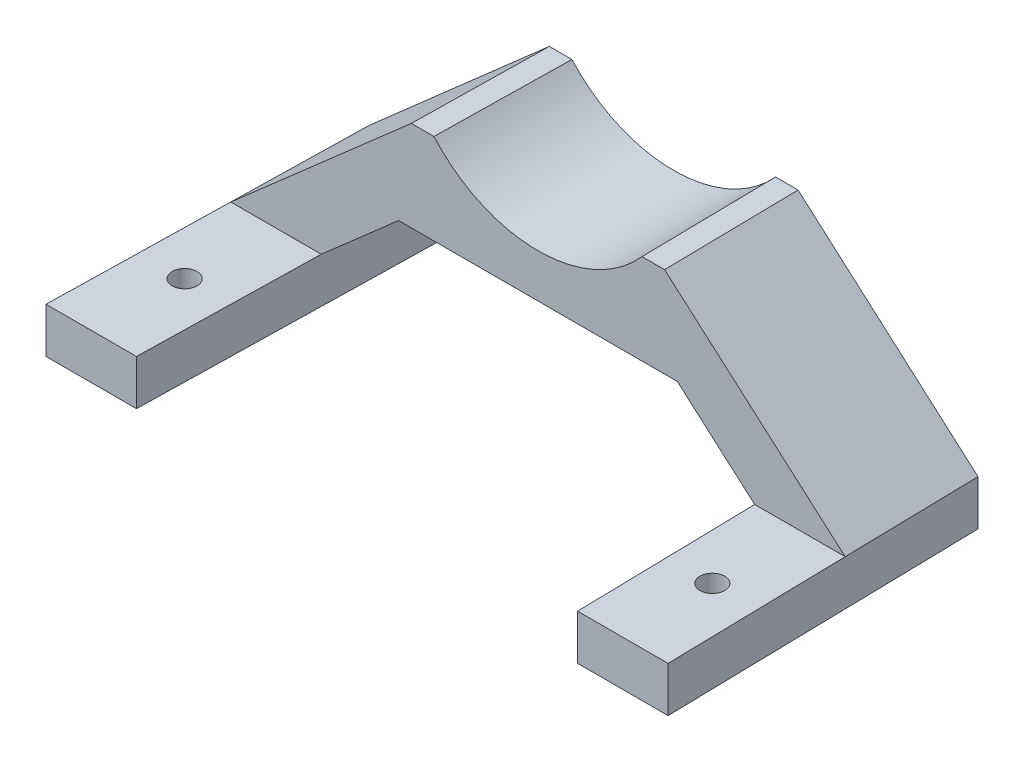
ISO-10303-21;
HEADER;
FILE_DESCRIPTION(('STEP AP214'),'2;1');
FILE_NAME('part.step','',(''),(''),'','','');
FILE_SCHEMA(('AUTOMOTIVE_DESIGN { 1 0 10303 214 1 1 1 1 }'));
ENDSEC;
DATA;
#1=APPLICATION_CONTEXT('core data for automotive mechanical design processes');
#2=APPLICATION_PROTOCOL_DEFINITION('international standard','automotive_design',2000,#1);
#3=PRODUCT_CONTEXT('',#1,'mechanical');
#4=PRODUCT('Part','Part','',(#3));
#5=PRODUCT_RELATED_PRODUCT_CATEGORY('part','',(#4));
#6=PRODUCT_DEFINITION_FORMATION('','',#4);
#7=PRODUCT_DEFINITION_CONTEXT('part definition',#1,'design');
#8=PRODUCT_DEFINITION('design','',#6,#7);
#9=PRODUCT_DEFINITION_SHAPE('','',#8);
#10=(LENGTH_UNIT() NAMED_UNIT(*) SI_UNIT(.MILLI.,.METRE.));
#11=(NAMED_UNIT(*) PLANE_ANGLE_UNIT() SI_UNIT($,.RADIAN.));
#12=(NAMED_UNIT(*) SI_UNIT($,.STERADIAN.) SOLID_ANGLE_UNIT());
#13=UNCERTAINTY_MEASURE_WITH_UNIT(LENGTH_MEASURE(1.E-05),#10,'distance_accuracy_value','');
#14=(GEOMETRIC_REPRESENTATION_CONTEXT(3) GLOBAL_UNCERTAINTY_ASSIGNED_CONTEXT((#13)) GLOBAL_UNIT_ASSIGNED_CONTEXT((#10,
#11,#12)) REPRESENTATION_CONTEXT('',''));
#15=CARTESIAN_POINT('',(0.,0.,0.));
#16=DIRECTION('',(0.,0.,1.));
#17=DIRECTION('',(1.,0.,0.));
#18=AXIS2_PLACEMENT_3D('',#15,#16,#17);
#19=CARTESIAN_POINT('',(0.,10.,0.));
#20=DIRECTION('',(0.,1.,0.));
#21=DIRECTION('',(0.,0.,1.));
#22=AXIS2_PLACEMENT_3D('',#19,#20,#21);
#23=PLANE('',#22);
#24=CARTESIAN_POINT('',(10.43092460845,10.,-20.2120416113355));
#25=DIRECTION('',(0.,1.,0.));
#26=DIRECTION('',(0.,0.,1.));
#27=AXIS2_PLACEMENT_3D('',#24,#25,#26);
#28=CIRCLE('',#27,2.75);
#29=CARTESIAN_POINT('',(10.43092460845,10.,-17.4620416113355));
#30=VERTEX_POINT('',#29);
#31=EDGE_CURVE('E724',#30,#30,#28,.T.);
#32=ORIENTED_EDGE('',*,*,#31,.F.);
#33=EDGE_LOOP('',(#32));
#34=FACE_BOUND('',#33,.T.);
#35=DIRECTION('',(0.0212041611335489,0.,-0.99977516650026));
#36=VECTOR('',#35,1.);
#37=CARTESIAN_POINT('',(20.0044976812242,10.,0.));
#38=LINE('',#37,#36);
#39=CARTESIAN_POINT('',(20.0044976812242,10.,0.));
#40=VERTEX_POINT('',#39);
#41=CARTESIAN_POINT('',(20.852854865681,10.,-40.0000000000001));
#42=VERTEX_POINT('',#41);
#43=EDGE_CURVE('E752',#40,#42,#38,.T.);
#44=ORIENTED_EDGE('',*,*,#43,.T.);
#45=DIRECTION('',(-1.,0.,0.));
#46=VECTOR('',#45,1.);
#47=CARTESIAN_POINT('',(0.848357184456768,10.,-40.));
#48=LINE('',#47,#46);
#49=CARTESIAN_POINT('',(0.848357184456767,10.,-40.));
#50=VERTEX_POINT('',#49);
#51=EDGE_CURVE('E96',#42,#50,#48,.T.);
#52=ORIENTED_EDGE('',*,*,#51,.T.);
#53=DIRECTION('',(-0.0212041611335489,0.,0.99977516650026));
#54=VECTOR('',#53,1.);
#55=CARTESIAN_POINT('',(1.48462507279934,10.,-70.));
#56=LINE('',#55,#54);
#57=CARTESIAN_POINT('',(0.,10.,0.));
#58=VERTEX_POINT('',#57);
#59=EDGE_CURVE('E743',#50,#58,#56,.T.);
#60=ORIENTED_EDGE('',*,*,#59,.T.);
#61=DIRECTION('',(1.,0.,0.));
#62=VECTOR('',#61,1.);
#63=CARTESIAN_POINT('',(0.,10.,0.));
#64=LINE('',#63,#62);
#65=EDGE_CURVE('E739',#58,#40,#64,.T.);
#66=ORIENTED_EDGE('',*,*,#65,.T.);
#67=EDGE_LOOP('',(#44,#52,#60,#66));
#68=FACE_BOUND('',#67,.T.);
#69=ADVANCED_FACE('F78',(#34,#68),#23,.T.);
#70=CARTESIAN_POINT('',(0.,0.,0.));
#71=DIRECTION('',(0.,1.,0.));
#72=DIRECTION('',(0.,0.,1.));
#73=AXIS2_PLACEMENT_3D('',#70,#71,#72);
#74=PLANE('',#73);
#75=DIRECTION('',(-0.0212041611335489,0.,0.99977516650026));
#76=VECTOR('',#75,1.);
#77=CARTESIAN_POINT('',(1.48462507279934,0.,-70.));
#78=LINE('',#77,#76);
#79=CARTESIAN_POINT('',(1.48462507279934,0.,-70.));
#80=VERTEX_POINT('',#79);
#81=CARTESIAN_POINT('',(0.,0.,0.));
#82=VERTEX_POINT('',#81);
#83=EDGE_CURVE('E733',#80,#82,#78,.T.);
#84=ORIENTED_EDGE('',*,*,#83,.F.);
#85=DIRECTION('',(-1.,0.,0.));
#86=VECTOR('',#85,1.);
#87=CARTESIAN_POINT('',(21.4891227540235,0.,-70.));
#88=LINE('',#87,#86);
#89=CARTESIAN_POINT('',(21.4891227540235,0.,-70.));
#90=VERTEX_POINT('',#89);
#91=EDGE_CURVE('E1061',#90,#80,#88,.T.);
#92=ORIENTED_EDGE('',*,*,#91,.F.);
#93=DIRECTION('',(0.0212041611335489,0.,-0.99977516650026));
#94=VECTOR('',#93,1.);
#95=CARTESIAN_POINT('',(20.0044976812242,0.,0.));
#96=LINE('',#95,#94);
#97=CARTESIAN_POINT('',(20.0044976812242,0.,0.));
#98=VERTEX_POINT('',#97);
#99=EDGE_CURVE('E1055',#98,#90,#96,.T.);
#100=ORIENTED_EDGE('',*,*,#99,.F.);
#101=DIRECTION('',(1.,0.,0.));
#102=VECTOR('',#101,1.);
#103=CARTESIAN_POINT('',(0.,0.,0.));
#104=LINE('',#103,#102);
#105=EDGE_CURVE('E1047',#82,#98,#104,.T.);
#106=ORIENTED_EDGE('',*,*,#105,.F.);
#107=EDGE_LOOP('',(#84,#92,#100,#106));
#108=FACE_BOUND('',#107,.T.);
#109=CARTESIAN_POINT('',(10.43092460845,0.,-20.2120416113355));
#110=DIRECTION('',(0.,1.,0.));
#111=DIRECTION('',(0.,0.,1.));
#112=AXIS2_PLACEMENT_3D('',#109,#110,#111);
#113=CIRCLE('',#112,2.75);
#114=CARTESIAN_POINT('',(10.43092460845,0.,-17.4620416113355));
#115=VERTEX_POINT('',#114);
#116=EDGE_CURVE('E346',#115,#115,#113,.T.);
#117=ORIENTED_EDGE('',*,*,#116,.T.);
#118=EDGE_LOOP('',(#117));
#119=FACE_BOUND('',#118,.T.);
#120=ADVANCED_FACE('F376',(#108,#119),#74,.F.);
#121=CARTESIAN_POINT('',(1.48462507279934,10.,-70.));
#122=DIRECTION('',(0.99977516650026,0.,0.0212041611335489));
#123=DIRECTION('',(0.0212041611335489,0.,-0.99977516650026));
#124=AXIS2_PLACEMENT_3D('',#121,#122,#123);
#125=PLANE('',#124);
#126=ORIENTED_EDGE('',*,*,#83,.T.);
#127=DIRECTION('',(0.,-1.,0.));
#128=VECTOR('',#127,1.);
#129=CARTESIAN_POINT('',(0.,10.,0.));
#130=LINE('',#129,#128);
#131=EDGE_CURVE('E14',#58,#82,#130,.T.);
#132=ORIENTED_EDGE('',*,*,#131,.F.);
#133=ORIENTED_EDGE('',*,*,#59,.F.);
#134=CARTESIAN_POINT('',(1.48462507279934,10.,-70.));
#135=VERTEX_POINT('',#134);
#136=EDGE_CURVE('E746',#135,#50,#56,.T.);
#137=ORIENTED_EDGE('',*,*,#136,.F.);
#138=DIRECTION('',(0.,-1.,0.));
#139=VECTOR('',#138,1.);
#140=CARTESIAN_POINT('',(1.48462507279934,10.,-70.));
#141=LINE('',#140,#139);
#142=EDGE_CURVE('E425',#135,#80,#141,.T.);
#143=ORIENTED_EDGE('',*,*,#142,.T.);
#144=EDGE_LOOP('',(#126,#132,#133,#137,#143));
#145=FACE_BOUND('',#144,.T.);
#146=ADVANCED_FACE('F80',(#145),#125,.F.);
#147=CARTESIAN_POINT('',(0.,10.,0.));
#148=DIRECTION('',(0.,0.,-1.));
#149=DIRECTION('',(-1.,0.,0.));
#150=AXIS2_PLACEMENT_3D('',#147,#148,#149);
#151=PLANE('',#150);
#152=ORIENTED_EDGE('',*,*,#105,.T.);
#153=DIRECTION('',(0.,-1.,0.));
#154=VECTOR('',#153,1.);
#155=CARTESIAN_POINT('',(20.0044976812242,10.,0.));
#156=LINE('',#155,#154);
#157=EDGE_CURVE('E88',#40,#98,#156,.T.);
#158=ORIENTED_EDGE('',*,*,#157,.F.);
#159=ORIENTED_EDGE('',*,*,#65,.F.);
#160=ORIENTED_EDGE('',*,*,#131,.T.);
#161=EDGE_LOOP('',(#152,#158,#159,#160));
#162=FACE_BOUND('',#161,.T.);
#163=ADVANCED_FACE('F994',(#162),#151,.F.);
#164=CARTESIAN_POINT('',(20.0044976812242,10.,0.));
#165=DIRECTION('',(-0.99977516650026,0.,-0.0212041611335489));
#166=DIRECTION('',(-0.0212041611335489,0.,0.99977516650026));
#167=AXIS2_PLACEMENT_3D('',#164,#165,#166);
#168=PLANE('',#167);
#169=ORIENTED_EDGE('',*,*,#99,.T.);
#170=DIRECTION('',(0.,-1.,0.));
#171=VECTOR('',#170,1.);
#172=CARTESIAN_POINT('',(21.4891227540235,10.,-70.));
#173=LINE('',#172,#171);
#174=CARTESIAN_POINT('',(21.4891227540235,10.,-70.));
#175=VERTEX_POINT('',#174);
#176=EDGE_CURVE('E751',#175,#90,#173,.T.);
#177=ORIENTED_EDGE('',*,*,#176,.F.);
#178=DIRECTION('',(-0.0212041611335488,0.,0.99977516650026));
#179=VECTOR('',#178,1.);
#180=CARTESIAN_POINT('',(21.4891227540235,10.,-70.));
#181=LINE('',#180,#179);
#182=EDGE_CURVE('E104',#175,#42,#181,.T.);
#183=ORIENTED_EDGE('',*,*,#182,.T.);
#184=ORIENTED_EDGE('',*,*,#43,.F.);
#185=ORIENTED_EDGE('',*,*,#157,.T.);
#186=EDGE_LOOP('',(#169,#177,#183,#184,#185));
#187=FACE_BOUND('',#186,.T.);
#188=ADVANCED_FACE('F375',(#187),#168,.F.);
#189=CARTESIAN_POINT('',(21.4891227540235,10.,-70.));
#190=DIRECTION('',(0.,0.,1.));
#191=DIRECTION('',(1.,0.,0.));
#192=AXIS2_PLACEMENT_3D('',#189,#190,#191);
#193=PLANE('',#192);
#194=ORIENTED_EDGE('',*,*,#91,.T.);
#195=ORIENTED_EDGE('',*,*,#142,.F.);
#196=DIRECTION('',(0.750766193418776,0.660568030424938,0.));
#197=VECTOR('',#196,1.);
#198=CARTESIAN_POINT('',(41.2637478268229,45.,-70.));
#199=LINE('',#198,#197);
#200=CARTESIAN_POINT('',(41.2637478268229,45.,-70.));
#201=VERTEX_POINT('',#200);
#202=EDGE_CURVE('E266',#135,#201,#199,.T.);
#203=ORIENTED_EDGE('',*,*,#202,.T.);
#204=DIRECTION('',(1.,0.,0.));
#205=VECTOR('',#204,1.);
#206=CARTESIAN_POINT('',(46.2637478268229,45.,-70.));
#207=LINE('',#206,#205);
#208=CARTESIAN_POINT('',(46.2637478268229,45.,-70.));
#209=VERTEX_POINT('',#208);
#210=EDGE_CURVE('E260',#201,#209,#207,.T.);
#211=ORIENTED_EDGE('',*,*,#210,.T.);
#212=CARTESIAN_POINT('',(68.7637478268229,65.3125,-70.));
#213=DIRECTION('',(0.,0.,1.));
#214=DIRECTION('',(-1.,0.,0.));
#215=AXIS2_PLACEMENT_3D('',#212,#213,#214);
#216=CIRCLE('',#215,30.3125);
#217=CARTESIAN_POINT('',(91.2637478268229,45.,-70.));
#218=VERTEX_POINT('',#217);
#219=EDGE_CURVE('E254',#209,#218,#216,.T.);
#220=ORIENTED_EDGE('',*,*,#219,.T.);
#221=DIRECTION('',(1.,0.,0.));
#222=VECTOR('',#221,1.);
#223=CARTESIAN_POINT('',(91.2637478268229,45.,-70.));
#224=LINE('',#223,#222);
#225=CARTESIAN_POINT('',(96.2637478268229,45.,-70.));
#226=VERTEX_POINT('',#225);
#227=EDGE_CURVE('E296',#218,#226,#224,.T.);
#228=ORIENTED_EDGE('',*,*,#227,.T.);
#229=DIRECTION('',(0.750766193418776,-0.660568030424938,0.));
#230=VECTOR('',#229,1.);
#231=CARTESIAN_POINT('',(136.042870580846,10.,-70.));
#232=LINE('',#231,#230);
#233=CARTESIAN_POINT('',(136.042870580846,10.,-70.));
#234=VERTEX_POINT('',#233);
#235=EDGE_CURVE('E291',#226,#234,#232,.T.);
#236=ORIENTED_EDGE('',*,*,#235,.T.);
#237=DIRECTION('',(0.,-1.,0.));
#238=VECTOR('',#237,1.);
#239=CARTESIAN_POINT('',(136.042870580846,10.,-70.));
#240=LINE('',#239,#238);
#241=CARTESIAN_POINT('',(136.042870580846,0.,-70.));
#242=VERTEX_POINT('',#241);
#243=EDGE_CURVE('E202',#234,#242,#240,.T.);
#244=ORIENTED_EDGE('',*,*,#243,.T.);
#245=DIRECTION('',(-1.,0.,0.));
#246=VECTOR('',#245,1.);
#247=CARTESIAN_POINT('',(116.038372899622,0.,-70.));
#248=LINE('',#247,#246);
#249=CARTESIAN_POINT('',(116.038372899622,0.,-70.));
#250=VERTEX_POINT('',#249);
#251=EDGE_CURVE('E196',#242,#250,#248,.T.);
#252=ORIENTED_EDGE('',*,*,#251,.T.);
#253=DIRECTION('',(0.,-1.,0.));
#254=VECTOR('',#253,1.);
#255=CARTESIAN_POINT('',(116.038372899622,10.,-70.));
#256=LINE('',#255,#254);
#257=CARTESIAN_POINT('',(116.038372899622,10.,-70.));
#258=VERTEX_POINT('',#257);
#259=EDGE_CURVE('E199',#258,#250,#256,.T.);
#260=ORIENTED_EDGE('',*,*,#259,.F.);
#261=DIRECTION('',(-0.750766193418776,0.660568030424938,0.));
#262=VECTOR('',#261,1.);
#263=CARTESIAN_POINT('',(98.9901774336121,25.,-70.));
#264=LINE('',#263,#262);
#265=CARTESIAN_POINT('',(98.9901774336121,25.,-70.));
#266=VERTEX_POINT('',#265);
#267=EDGE_CURVE('E286',#258,#266,#264,.T.);
#268=ORIENTED_EDGE('',*,*,#267,.T.);
#269=DIRECTION('',(-1.,0.,0.));
#270=VECTOR('',#269,1.);
#271=CARTESIAN_POINT('',(98.9901774336121,25.,-70.));
#272=LINE('',#271,#270);
#273=CARTESIAN_POINT('',(38.5373182200336,25.,-70.));
#274=VERTEX_POINT('',#273);
#275=EDGE_CURVE('E281',#266,#274,#272,.T.);
#276=ORIENTED_EDGE('',*,*,#275,.T.);
#277=DIRECTION('',(-0.750766193418776,-0.660568030424938,0.));
#278=VECTOR('',#277,1.);
#279=CARTESIAN_POINT('',(38.5373182200336,25.,-70.));
#280=LINE('',#279,#278);
#281=EDGE_CURVE('E275',#274,#175,#280,.T.);
#282=ORIENTED_EDGE('',*,*,#281,.T.);
#283=ORIENTED_EDGE('',*,*,#176,.T.);
#284=EDGE_LOOP('',(#194,#195,#203,#211,#220,#228,#236,#244,#252,#260,#268,#276,#282,#283));
#285=FACE_BOUND('',#284,.T.);
#286=ADVANCED_FACE('F198',(#285),#193,.F.);
#287=CARTESIAN_POINT('',(10.43092460845,10.,-20.2120416113355));
#288=DIRECTION('',(0.,-1.,0.));
#289=DIRECTION('',(0.,0.,-1.));
#290=AXIS2_PLACEMENT_3D('',#287,#288,#289);
#291=CYLINDRICAL_SURFACE('',#290,2.75);
#292=ORIENTED_EDGE('',*,*,#31,.T.);
#293=EDGE_LOOP('',(#292));
#294=FACE_BOUND('',#293,.T.);
#295=ORIENTED_EDGE('',*,*,#116,.F.);
#296=EDGE_LOOP('',(#295));
#297=FACE_BOUND('',#296,.T.);
#298=ADVANCED_FACE('F374',(#294,#297),#291,.F.);
#299=CARTESIAN_POINT('',(68.7637478268229,65.3125,-40.));
#300=DIRECTION('',(0.,0.,-1.));
#301=DIRECTION('',(-1.,0.,0.));
#302=AXIS2_PLACEMENT_3D('',#299,#300,#301);
#303=PLANE('',#302);
#304=DIRECTION('',(-1.,0.,0.));
#305=VECTOR('',#304,1.);
#306=CARTESIAN_POINT('',(116.674640787965,10.,-40.));
#307=LINE('',#306,#305);
#308=CARTESIAN_POINT('',(136.679138469189,10.,-40.));
#309=VERTEX_POINT('',#308);
#310=CARTESIAN_POINT('',(116.674640787965,10.,-40.));
#311=VERTEX_POINT('',#310);
#312=EDGE_CURVE('E309',#309,#311,#307,.T.);
#313=ORIENTED_EDGE('',*,*,#312,.F.);
#314=DIRECTION('',(0.751885170244489,-0.659294085189922,0.));
#315=VECTOR('',#314,1.);
#316=CARTESIAN_POINT('',(136.679138469189,10.,-40.));
#317=LINE('',#316,#315);
#318=CARTESIAN_POINT('',(96.7637478268229,45.,-40.));
#319=VERTEX_POINT('',#318);
#320=EDGE_CURVE('E304',#319,#309,#317,.T.);
#321=ORIENTED_EDGE('',*,*,#320,.F.);
#322=DIRECTION('',(1.,0.,0.));
#323=VECTOR('',#322,1.);
#324=CARTESIAN_POINT('',(96.7637478268229,45.,-40.));
#325=LINE('',#324,#323);
#326=CARTESIAN_POINT('',(91.7637478268229,45.,-40.));
#327=VERTEX_POINT('',#326);
#328=EDGE_CURVE('E308',#327,#319,#325,.T.);
#329=ORIENTED_EDGE('',*,*,#328,.F.);
#330=CARTESIAN_POINT('',(68.7637478268229,65.3125,-40.));
#331=DIRECTION('',(0.,0.,1.));
#332=DIRECTION('',(-1.,0.,0.));
#333=AXIS2_PLACEMENT_3D('',#330,#331,#332);
#334=CIRCLE('',#333,30.6854632725334);
#335=CARTESIAN_POINT('',(45.7637478268229,45.,-40.));
#336=VERTEX_POINT('',#335);
#337=EDGE_CURVE('E314',#336,#327,#334,.T.);
#338=ORIENTED_EDGE('',*,*,#337,.F.);
#339=DIRECTION('',(1.,0.,0.));
#340=VECTOR('',#339,1.);
#341=CARTESIAN_POINT('',(45.7637478268229,45.,-40.));
#342=LINE('',#341,#340);
#343=CARTESIAN_POINT('',(40.7637478268229,45.,-40.));
#344=VERTEX_POINT('',#343);
#345=EDGE_CURVE('E319',#344,#336,#342,.T.);
#346=ORIENTED_EDGE('',*,*,#345,.F.);
#347=DIRECTION('',(0.751885170244489,0.659294085189922,0.));
#348=VECTOR('',#347,1.);
#349=CARTESIAN_POINT('',(40.7637478268229,45.,-40.));
#350=LINE('',#349,#348);
#351=EDGE_CURVE('E324',#50,#344,#350,.T.);
#352=ORIENTED_EDGE('',*,*,#351,.F.);
#353=ORIENTED_EDGE('',*,*,#51,.F.);
#354=DIRECTION('',(-0.751885170244489,-0.659294085189921,0.));
#355=VECTOR('',#354,1.);
#356=CARTESIAN_POINT('',(20.852854865681,10.,-40.));
#357=LINE('',#356,#355);
#358=CARTESIAN_POINT('',(37.9594508552665,25.,-40.));
#359=VERTEX_POINT('',#358);
#360=EDGE_CURVE('E331',#359,#42,#357,.T.);
#361=ORIENTED_EDGE('',*,*,#360,.F.);
#362=DIRECTION('',(-1.,0.,0.));
#363=VECTOR('',#362,1.);
#364=CARTESIAN_POINT('',(99.5680447983793,25.,-40.));
#365=LINE('',#364,#363);
#366=CARTESIAN_POINT('',(99.5680447983793,25.,-40.));
#367=VERTEX_POINT('',#366);
#368=EDGE_CURVE('E335',#367,#359,#365,.T.);
#369=ORIENTED_EDGE('',*,*,#368,.F.);
#370=DIRECTION('',(-0.751885170244489,0.659294085189922,0.));
#371=VECTOR('',#370,1.);
#372=CARTESIAN_POINT('',(99.5680447983793,25.,-40.));
#373=LINE('',#372,#371);
#374=EDGE_CURVE('E340',#311,#367,#373,.T.);
#375=ORIENTED_EDGE('',*,*,#374,.F.);
#376=EDGE_LOOP('',(#313,#321,#329,#338,#346,#352,#353,#361,#369,#375));
#377=FACE_BOUND('',#376,.T.);
#378=ADVANCED_FACE('F644',(#377),#303,.F.);
#379=CARTESIAN_POINT('',(0.,45.,0.));
#380=DIRECTION('',(0.,1.,0.));
#381=DIRECTION('',(0.,0.,1.));
#382=AXIS2_PLACEMENT_3D('',#379,#380,#381);
#383=PLANE('',#382);
#384=DIRECTION('',(-0.0166643523339933,0.,0.9998611400396));
#385=VECTOR('',#384,1.);
#386=CARTESIAN_POINT('',(41.2637478268229,45.,-70.));
#387=LINE('',#386,#385);
#388=EDGE_CURVE('E301',#201,#344,#387,.T.);
#389=ORIENTED_EDGE('',*,*,#388,.T.);
#390=ORIENTED_EDGE('',*,*,#345,.T.);
#391=DIRECTION('',(-0.0166643523339933,0.,0.9998611400396));
#392=VECTOR('',#391,1.);
#393=CARTESIAN_POINT('',(46.2637478268229,45.,-70.));
#394=LINE('',#393,#392);
#395=EDGE_CURVE('E437',#209,#336,#394,.T.);
#396=ORIENTED_EDGE('',*,*,#395,.F.);
#397=ORIENTED_EDGE('',*,*,#210,.F.);
#398=EDGE_LOOP('',(#389,#390,#396,#397));
#399=FACE_BOUND('',#398,.T.);
#400=ADVANCED_FACE('F434',(#399),#383,.T.);
#401=CARTESIAN_POINT('',(91.2637478268229,45.,-70.));
#402=CARTESIAN_POINT('',(91.7637478268229,45.,-40.));
#403=CARTESIAN_POINT('',(78.3782852717568,30.726872246696,-70.));
#404=CARTESIAN_POINT('',(78.6608319695942,30.1634675831996,-40.));
#405=CARTESIAN_POINT('',(59.149210381889,30.726872246696,-70.));
#406=CARTESIAN_POINT('',(58.8666636840515,30.1634675831996,-40.));
#407=CARTESIAN_POINT('',(46.2637478268229,45.,-70.));
#408=CARTESIAN_POINT('',(45.7637478268229,45.,-40.));
#409=(BOUNDED_SURFACE() B_SPLINE_SURFACE(3,1,((#401,#402),(#403,#404),(#405,#406),(#407,#408)),
.UNSPECIFIED.,.F.,.F.,.F.) B_SPLINE_SURFACE_WITH_KNOTS((4,4),(2,2),(0.,1.),(0.,1.),
.UNSPECIFIED.) GEOMETRIC_REPRESENTATION_ITEM() RATIONAL_B_SPLINE_SURFACE(((1.,1.),
(0.780068728522336,0.774638929615068),(0.780068728522336,0.774638929615068),(1.,1.))) REPRESENTATION_ITEM('') SURFACE());
#410=DIRECTION('',(0.0166643523339933,0.,0.9998611400396));
#411=VECTOR('',#410,1.);
#412=CARTESIAN_POINT('',(91.2637478268229,45.,-70.));
#413=LINE('',#412,#411);
#414=EDGE_CURVE('E352',#218,#327,#413,.T.);
#415=ORIENTED_EDGE('',*,*,#219,.F.);
#416=ORIENTED_EDGE('',*,*,#395,.T.);
#417=ORIENTED_EDGE('',*,*,#337,.T.);
#418=ORIENTED_EDGE('',*,*,#414,.F.);
#419=EDGE_LOOP('',(#415,#416,#417,#418));
#420=FACE_BOUND('',#419,.T.);
#421=ADVANCED_FACE('F472',(#420),#409,.T.);
#422=CARTESIAN_POINT('',(41.2637478268229,45.,-70.));
#423=CARTESIAN_POINT('',(40.7637478268229,45.,-40.));
#424=CARTESIAN_POINT('',(34.6338940344856,39.1666666666667,-70.));
#425=CARTESIAN_POINT('',(34.1111827197619,39.1666666666667,-40.));
#426=CARTESIAN_POINT('',(28.0040402421484,33.3333333333333,-70.));
#427=CARTESIAN_POINT('',(27.4586176127008,33.3333333333333,-40.));
#428=CARTESIAN_POINT('',(14.7443326574739,21.6666666666667,-70.));
#429=CARTESIAN_POINT('',(14.1534873985788,21.6666666666667,-40.));
#430=CARTESIAN_POINT('',(8.11447886513661,15.8333333333333,-70.));
#431=CARTESIAN_POINT('',(7.50092229151779,15.8333333333333,-40.));
#432=CARTESIAN_POINT('',(1.48462507279934,10.,-70.));
#433=CARTESIAN_POINT('',(0.84835718445677,10.,-40.));
#434=B_SPLINE_SURFACE_WITH_KNOTS('',3,1,((#422,#423),(#424,#425),(#426,#427),(#428,#429),(#430,
#431),(#432,#433)),.UNSPECIFIED.,.F.,.F.,.F.,(4,2,4),(2,2),(0.,0.5,1.),(0.,1.),.UNSPECIFIED.);
#435=ORIENTED_EDGE('',*,*,#202,.F.);
#436=ORIENTED_EDGE('',*,*,#136,.T.);
#437=ORIENTED_EDGE('',*,*,#351,.T.);
#438=ORIENTED_EDGE('',*,*,#388,.F.);
#439=EDGE_LOOP('',(#435,#436,#437,#438));
#440=FACE_BOUND('',#439,.T.);
#441=ADVANCED_FACE('F440',(#440),#434,.T.);
#442=CARTESIAN_POINT('',(21.4891227540235,10.,-70.));
#443=CARTESIAN_POINT('',(20.852854865681,10.,-40.));
#444=CARTESIAN_POINT('',(24.3304886650252,12.5,-70.));
#445=CARTESIAN_POINT('',(23.7039541972785,12.5,-40.));
#446=CARTESIAN_POINT('',(27.1718545760269,15.,-70.));
#447=CARTESIAN_POINT('',(26.5550535288761,15.,-40.));
#448=CARTESIAN_POINT('',(32.8545863980303,20.,-70.));
#449=CARTESIAN_POINT('',(32.2572521920713,20.,-40.));
#450=CARTESIAN_POINT('',(35.695952309032,22.5,-70.));
#451=CARTESIAN_POINT('',(35.1083515236689,22.5,-40.));
#452=CARTESIAN_POINT('',(38.5373182200336,25.,-70.));
#453=CARTESIAN_POINT('',(37.9594508552665,25.,-40.));
#454=B_SPLINE_SURFACE_WITH_KNOTS('',3,1,((#442,#443),(#444,#445),(#446,#447),(#448,#449),(#450,
#451),(#452,#453)),.UNSPECIFIED.,.F.,.F.,.F.,(4,2,4),(2,2),(0.,0.5,1.),(0.,1.),.UNSPECIFIED.);
#455=DIRECTION('',(-0.0192586730113695,0.,0.999814534558206));
#456=VECTOR('',#455,1.);
#457=CARTESIAN_POINT('',(38.24838453765,25.,-55.));
#458=LINE('',#457,#456);
#459=EDGE_CURVE('E546',#274,#359,#458,.T.);
#460=ORIENTED_EDGE('',*,*,#281,.F.);
#461=ORIENTED_EDGE('',*,*,#459,.T.);
#462=ORIENTED_EDGE('',*,*,#360,.T.);
#463=ORIENTED_EDGE('',*,*,#182,.F.);
#464=EDGE_LOOP('',(#460,#461,#462,#463));
#465=FACE_BOUND('',#464,.T.);
#466=ADVANCED_FACE('F471',(#465),#454,.T.);
#467=CARTESIAN_POINT('',(0.,25.,0.));
#468=DIRECTION('',(0.,-1.,0.));
#469=DIRECTION('',(0.,0.,-1.));
#470=AXIS2_PLACEMENT_3D('',#467,#468,#469);
#471=PLANE('',#470);
#472=DIRECTION('',(0.0192586730113693,0.,0.999814534558206));
#473=VECTOR('',#472,1.);
#474=CARTESIAN_POINT('',(98.9901774336121,25.,-70.));
#475=LINE('',#474,#473);
#476=EDGE_CURVE('E538',#266,#367,#475,.T.);
#477=ORIENTED_EDGE('',*,*,#476,.T.);
#478=ORIENTED_EDGE('',*,*,#368,.T.);
#479=ORIENTED_EDGE('',*,*,#459,.F.);
#480=ORIENTED_EDGE('',*,*,#275,.F.);
#481=EDGE_LOOP('',(#477,#478,#479,#480));
#482=FACE_BOUND('',#481,.T.);
#483=ADVANCED_FACE('F516',(#482),#471,.T.);
#484=CARTESIAN_POINT('',(98.9901774336121,25.,-70.));
#485=CARTESIAN_POINT('',(99.5680447983793,25.,-40.));
#486=CARTESIAN_POINT('',(101.831543344614,22.5,-70.));
#487=CARTESIAN_POINT('',(102.419144129977,22.5000000000001,-40.));
#488=CARTESIAN_POINT('',(104.672909255616,20.,-70.));
#489=CARTESIAN_POINT('',(105.270243461574,20.0000000000001,-40.));
#490=CARTESIAN_POINT('',(110.355641077619,15.,-70.));
#491=CARTESIAN_POINT('',(110.972442124769,15.0000000000001,-40.));
#492=CARTESIAN_POINT('',(113.197006988621,12.5,-70.));
#493=CARTESIAN_POINT('',(113.823541456367,12.5000000000001,-40.));
#494=CARTESIAN_POINT('',(116.038372899622,10.,-70.));
#495=CARTESIAN_POINT('',(116.674640787965,10.,-40.));
#496=B_SPLINE_SURFACE_WITH_KNOTS('',3,1,((#484,#485),(#486,#487),(#488,#489),(#490,#491),(#492,
#493),(#494,#495)),.UNSPECIFIED.,.F.,.F.,.F.,(4,2,4),(2,2),(0.,0.5,1.),(0.,1.),.UNSPECIFIED.);
#497=DIRECTION('',(0.0212041611335489,0.,0.99977516650026));
#498=VECTOR('',#497,1.);
#499=CARTESIAN_POINT('',(116.356506843793,10.,-55.));
#500=LINE('',#499,#498);
#501=EDGE_CURVE('E217',#258,#311,#500,.T.);
#502=ORIENTED_EDGE('',*,*,#267,.F.);
#503=ORIENTED_EDGE('',*,*,#501,.T.);
#504=ORIENTED_EDGE('',*,*,#374,.T.);
#505=ORIENTED_EDGE('',*,*,#476,.F.);
#506=EDGE_LOOP('',(#502,#503,#504,#505));
#507=FACE_BOUND('',#506,.T.);
#508=ADVANCED_FACE('F525',(#507),#496,.T.);
#509=CARTESIAN_POINT('',(136.042870580846,10.,-70.));
#510=CARTESIAN_POINT('',(136.679138469189,10.,-40.));
#511=CARTESIAN_POINT('',(129.413016788509,15.8333333333333,-70.));
#512=CARTESIAN_POINT('',(130.026573362128,15.8333333333333,-40.));
#513=CARTESIAN_POINT('',(122.783162996172,21.6666666666667,-70.));
#514=CARTESIAN_POINT('',(123.374008255067,21.6666666666667,-40.));
#515=CARTESIAN_POINT('',(109.523455411497,33.3333333333333,-70.));
#516=CARTESIAN_POINT('',(110.068878040945,33.3333333333333,-40.));
#517=CARTESIAN_POINT('',(102.89360161916,39.1666666666667,-70.));
#518=CARTESIAN_POINT('',(103.416312933884,39.1666666666667,-40.));
#519=CARTESIAN_POINT('',(96.2637478268229,45.,-70.));
#520=CARTESIAN_POINT('',(96.7637478268229,45.,-40.));
#521=B_SPLINE_SURFACE_WITH_KNOTS('',3,1,((#509,#510),(#511,#512),(#513,#514),(#515,#516),(#517,
#518),(#519,#520)),.UNSPECIFIED.,.F.,.F.,.F.,(4,2,4),(2,2),(0.,0.5,1.),(0.,1.),.UNSPECIFIED.);
#522=DIRECTION('',(0.0166643523339933,0.,0.9998611400396));
#523=VECTOR('',#522,1.);
#524=CARTESIAN_POINT('',(96.5137478268229,45.,-55.));
#525=LINE('',#524,#523);
#526=EDGE_CURVE('E568',#226,#319,#525,.T.);
#527=DIRECTION('',(0.0212041611335485,0.,0.99977516650026));
#528=VECTOR('',#527,1.);
#529=CARTESIAN_POINT('',(136.042870580846,10.,-70.));
#530=LINE('',#529,#528);
#531=EDGE_CURVE('E562',#234,#309,#530,.T.);
#532=ORIENTED_EDGE('',*,*,#235,.F.);
#533=ORIENTED_EDGE('',*,*,#526,.T.);
#534=ORIENTED_EDGE('',*,*,#320,.T.);
#535=ORIENTED_EDGE('',*,*,#531,.F.);
#536=EDGE_LOOP('',(#532,#533,#534,#535));
#537=FACE_BOUND('',#536,.T.);
#538=ADVANCED_FACE('F581',(#537),#521,.T.);
#539=CARTESIAN_POINT('',(0.,45.,0.));
#540=DIRECTION('',(0.,1.,0.));
#541=DIRECTION('',(0.,0.,1.));
#542=AXIS2_PLACEMENT_3D('',#539,#540,#541);
#543=PLANE('',#542);
#544=ORIENTED_EDGE('',*,*,#414,.T.);
#545=ORIENTED_EDGE('',*,*,#328,.T.);
#546=ORIENTED_EDGE('',*,*,#526,.F.);
#547=ORIENTED_EDGE('',*,*,#227,.F.);
#548=EDGE_LOOP('',(#544,#545,#546,#547));
#549=FACE_BOUND('',#548,.T.);
#550=ADVANCED_FACE('F592',(#549),#543,.T.);
#551=CARTESIAN_POINT('',(0.,10.,0.));
#552=DIRECTION('',(0.,-1.,0.));
#553=DIRECTION('',(0.,0.,-1.));
#554=AXIS2_PLACEMENT_3D('',#551,#552,#553);
#555=PLANE('',#554);
#556=CARTESIAN_POINT('',(127.096571045196,10.,-20.2120416113355));
#557=DIRECTION('',(0.,1.,0.));
#558=DIRECTION('',(0.,0.,-1.));
#559=AXIS2_PLACEMENT_3D('',#556,#557,#558);
#560=CIRCLE('',#559,2.75000000000001);
#561=CARTESIAN_POINT('',(127.096571045196,10.,-22.9620416113355));
#562=VERTEX_POINT('',#561);
#563=EDGE_CURVE('E226',#562,#562,#560,.T.);
#564=ORIENTED_EDGE('',*,*,#563,.F.);
#565=EDGE_LOOP('',(#564));
#566=FACE_BOUND('',#565,.T.);
#567=DIRECTION('',(-0.0212041611335489,0.,-0.99977516650026));
#568=VECTOR('',#567,1.);
#569=CARTESIAN_POINT('',(136.042870580846,10.,-70.));
#570=LINE('',#569,#568);
#571=CARTESIAN_POINT('',(137.527495653646,10.,0.));
#572=VERTEX_POINT('',#571);
#573=EDGE_CURVE('E219',#572,#309,#570,.T.);
#574=ORIENTED_EDGE('',*,*,#573,.T.);
#575=ORIENTED_EDGE('',*,*,#312,.T.);
#576=DIRECTION('',(0.0212041611335489,0.,0.99977516650026));
#577=VECTOR('',#576,1.);
#578=CARTESIAN_POINT('',(117.522997972422,10.,0.));
#579=LINE('',#578,#577);
#580=CARTESIAN_POINT('',(117.522997972422,10.,0.));
#581=VERTEX_POINT('',#580);
#582=EDGE_CURVE('E208',#311,#581,#579,.T.);
#583=ORIENTED_EDGE('',*,*,#582,.T.);
#584=DIRECTION('',(1.,0.,0.));
#585=VECTOR('',#584,1.);
#586=CARTESIAN_POINT('',(137.527495653646,10.,0.));
#587=LINE('',#586,#585);
#588=EDGE_CURVE('E240',#581,#572,#587,.T.);
#589=ORIENTED_EDGE('',*,*,#588,.T.);
#590=EDGE_LOOP('',(#574,#575,#583,#589));
#591=FACE_BOUND('',#590,.T.);
#592=ADVANCED_FACE('F651',(#566,#591),#555,.F.);
#593=CARTESIAN_POINT('',(0.,0.,0.));
#594=DIRECTION('',(0.,-1.,0.));
#595=DIRECTION('',(0.,0.,-1.));
#596=AXIS2_PLACEMENT_3D('',#593,#594,#595);
#597=PLANE('',#596);
#598=DIRECTION('',(0.0212041611335489,0.,0.99977516650026));
#599=VECTOR('',#598,1.);
#600=CARTESIAN_POINT('',(117.522997972422,0.,0.));
#601=LINE('',#600,#599);
#602=CARTESIAN_POINT('',(117.522997972422,0.,0.));
#603=VERTEX_POINT('',#602);
#604=EDGE_CURVE('E214',#250,#603,#601,.T.);
#605=ORIENTED_EDGE('',*,*,#604,.F.);
#606=ORIENTED_EDGE('',*,*,#251,.F.);
#607=DIRECTION('',(-0.0212041611335489,0.,-0.99977516650026));
#608=VECTOR('',#607,1.);
#609=CARTESIAN_POINT('',(136.042870580846,0.,-70.));
#610=LINE('',#609,#608);
#611=CARTESIAN_POINT('',(137.527495653646,0.,0.));
#612=VERTEX_POINT('',#611);
#613=EDGE_CURVE('E207',#612,#242,#610,.T.);
#614=ORIENTED_EDGE('',*,*,#613,.F.);
#615=DIRECTION('',(1.,0.,0.));
#616=VECTOR('',#615,1.);
#617=CARTESIAN_POINT('',(137.527495653646,0.,0.));
#618=LINE('',#617,#616);
#619=EDGE_CURVE('E223',#603,#612,#618,.T.);
#620=ORIENTED_EDGE('',*,*,#619,.F.);
#621=EDGE_LOOP('',(#605,#606,#614,#620));
#622=FACE_BOUND('',#621,.T.);
#623=CARTESIAN_POINT('',(127.096571045196,0.,-20.2120416113355));
#624=DIRECTION('',(0.,1.,0.));
#625=DIRECTION('',(0.,0.,-1.));
#626=AXIS2_PLACEMENT_3D('',#623,#624,#625);
#627=CIRCLE('',#626,2.75000000000001);
#628=CARTESIAN_POINT('',(127.096571045196,0.,-22.9620416113355));
#629=VERTEX_POINT('',#628);
#630=EDGE_CURVE('E233',#629,#629,#627,.T.);
#631=ORIENTED_EDGE('',*,*,#630,.T.);
#632=EDGE_LOOP('',(#631));
#633=FACE_BOUND('',#632,.T.);
#634=ADVANCED_FACE('F221',(#622,#633),#597,.T.);
#635=CARTESIAN_POINT('',(117.522997972422,10.,0.));
#636=DIRECTION('',(0.99977516650026,0.,-0.0212041611335489));
#637=DIRECTION('',(-0.0212041611335489,0.,-0.99977516650026));
#638=AXIS2_PLACEMENT_3D('',#635,#636,#637);
#639=PLANE('',#638);
#640=ORIENTED_EDGE('',*,*,#604,.T.);
#641=DIRECTION('',(0.,-1.,0.));
#642=VECTOR('',#641,1.);
#643=CARTESIAN_POINT('',(117.522997972422,10.,0.));
#644=LINE('',#643,#642);
#645=EDGE_CURVE('E840',#581,#603,#644,.T.);
#646=ORIENTED_EDGE('',*,*,#645,.F.);
#647=ORIENTED_EDGE('',*,*,#582,.F.);
#648=ORIENTED_EDGE('',*,*,#501,.F.);
#649=ORIENTED_EDGE('',*,*,#259,.T.);
#650=EDGE_LOOP('',(#640,#646,#647,#648,#649));
#651=FACE_BOUND('',#650,.T.);
#652=ADVANCED_FACE('F212',(#651),#639,.F.);
#653=CARTESIAN_POINT('',(137.527495653646,10.,0.));
#654=DIRECTION('',(0.,0.,-1.));
#655=DIRECTION('',(-1.,0.,0.));
#656=AXIS2_PLACEMENT_3D('',#653,#654,#655);
#657=PLANE('',#656);
#658=ORIENTED_EDGE('',*,*,#619,.T.);
#659=DIRECTION('',(0.,-1.,0.));
#660=VECTOR('',#659,1.);
#661=CARTESIAN_POINT('',(137.527495653646,10.,0.));
#662=LINE('',#661,#660);
#663=EDGE_CURVE('E359',#572,#612,#662,.T.);
#664=ORIENTED_EDGE('',*,*,#663,.F.);
#665=ORIENTED_EDGE('',*,*,#588,.F.);
#666=ORIENTED_EDGE('',*,*,#645,.T.);
#667=EDGE_LOOP('',(#658,#664,#665,#666));
#668=FACE_BOUND('',#667,.T.);
#669=ADVANCED_FACE('F659',(#668),#657,.F.);
#670=CARTESIAN_POINT('',(136.042870580846,10.,-70.));
#671=DIRECTION('',(-0.99977516650026,0.,0.0212041611335489));
#672=DIRECTION('',(0.0212041611335489,0.,0.99977516650026));
#673=AXIS2_PLACEMENT_3D('',#670,#671,#672);
#674=PLANE('',#673);
#675=ORIENTED_EDGE('',*,*,#613,.T.);
#676=ORIENTED_EDGE('',*,*,#243,.F.);
#677=ORIENTED_EDGE('',*,*,#531,.T.);
#678=ORIENTED_EDGE('',*,*,#573,.F.);
#679=ORIENTED_EDGE('',*,*,#663,.T.);
#680=EDGE_LOOP('',(#675,#676,#677,#678,#679));
#681=FACE_BOUND('',#680,.T.);
#682=ADVANCED_FACE('F649',(#681),#674,.F.);
#683=CARTESIAN_POINT('',(127.096571045196,10.,-20.2120416113355));
#684=DIRECTION('',(0.,-1.,0.));
#685=DIRECTION('',(0.,0.,-1.));
#686=AXIS2_PLACEMENT_3D('',#683,#684,#685);
#687=CYLINDRICAL_SURFACE('',#686,2.75000000000001);
#688=ORIENTED_EDGE('',*,*,#563,.T.);
#689=EDGE_LOOP('',(#688));
#690=FACE_BOUND('',#689,.T.);
#691=ORIENTED_EDGE('',*,*,#630,.F.);
#692=EDGE_LOOP('',(#691));
#693=FACE_BOUND('',#692,.T.);
#694=ADVANCED_FACE('F645',(#690,#693),#687,.F.);
#695=CLOSED_SHELL('',(#69,#120,#146,#163,#188,#286,#298,#378,#400,#421,#441,#466,#483,#508,#538,
#550,#592,#634,#652,#669,#682,#694));
#696=MANIFOLD_SOLID_BREP('B2',#695);
#697=ADVANCED_BREP_SHAPE_REPRESENTATION('',(#18,#696),#14);
#698=SHAPE_DEFINITION_REPRESENTATION(#9,#697);
ENDSEC;
END-ISO-10303-21;
